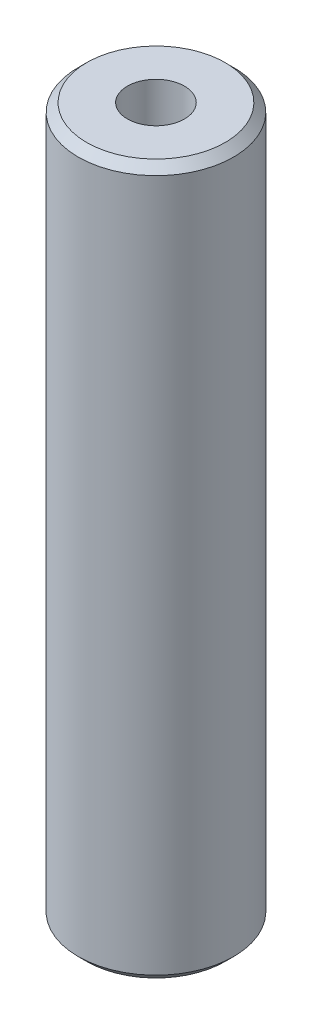
ISO-10303-21;
HEADER;
FILE_DESCRIPTION(('STEP AP214'),'2;1');
FILE_NAME('part.step','',(''),(''),'','','');
FILE_SCHEMA(('AUTOMOTIVE_DESIGN { 1 0 10303 214 1 1 1 1 }'));
ENDSEC;
DATA;
#1=APPLICATION_CONTEXT('core data for automotive mechanical design processes');
#2=APPLICATION_PROTOCOL_DEFINITION('international standard','automotive_design',2000,#1);
#3=PRODUCT_CONTEXT('',#1,'mechanical');
#4=PRODUCT('Part','Part','',(#3));
#5=PRODUCT_RELATED_PRODUCT_CATEGORY('part','',(#4));
#6=PRODUCT_DEFINITION_FORMATION('','',#4);
#7=PRODUCT_DEFINITION_CONTEXT('part definition',#1,'design');
#8=PRODUCT_DEFINITION('design','',#6,#7);
#9=PRODUCT_DEFINITION_SHAPE('','',#8);
#10=(LENGTH_UNIT() NAMED_UNIT(*) SI_UNIT(.MILLI.,.METRE.));
#11=(NAMED_UNIT(*) PLANE_ANGLE_UNIT() SI_UNIT($,.RADIAN.));
#12=(NAMED_UNIT(*) SI_UNIT($,.STERADIAN.) SOLID_ANGLE_UNIT());
#13=UNCERTAINTY_MEASURE_WITH_UNIT(LENGTH_MEASURE(1.E-05),#10,'distance_accuracy_value','');
#14=(GEOMETRIC_REPRESENTATION_CONTEXT(3) GLOBAL_UNCERTAINTY_ASSIGNED_CONTEXT((#13)) GLOBAL_UNIT_ASSIGNED_CONTEXT((#10,
#11,#12)) REPRESENTATION_CONTEXT('',''));
#15=CARTESIAN_POINT('',(0.,0.,0.));
#16=DIRECTION('',(0.,0.,1.));
#17=DIRECTION('',(1.,0.,0.));
#18=AXIS2_PLACEMENT_3D('',#15,#16,#17);
#19=CARTESIAN_POINT('',(0.,479.358730515074,0.));
#20=DIRECTION('',(0.,-1.,0.));
#21=DIRECTION('',(0.,0.,-1.));
#22=AXIS2_PLACEMENT_3D('',#19,#20,#21);
#23=CYLINDRICAL_SURFACE('',#22,52.5);
#24=CARTESIAN_POINT('',(0.,473.66451276738,0.));
#25=DIRECTION('',(0.,1.,0.));
#26=DIRECTION('',(0.,0.,1.));
#27=AXIS2_PLACEMENT_3D('',#24,#25,#26);
#28=CIRCLE('',#27,52.5);
#29=CARTESIAN_POINT('',(0.,473.66451276738,52.5));
#30=VERTEX_POINT('',#29);
#31=EDGE_CURVE('E50',#30,#30,#28,.F.);
#32=ORIENTED_EDGE('',*,*,#31,.T.);
#33=EDGE_LOOP('',(#32));
#34=FACE_BOUND('',#33,.T.);
#35=CARTESIAN_POINT('',(0.,5.69421774769352,0.));
#36=DIRECTION('',(0.,1.,0.));
#37=DIRECTION('',(0.,0.,1.));
#38=AXIS2_PLACEMENT_3D('',#35,#36,#37);
#39=CIRCLE('',#38,52.5);
#40=CARTESIAN_POINT('',(0.,5.69421774769352,52.5));
#41=VERTEX_POINT('',#40);
#42=EDGE_CURVE('E51',#41,#41,#39,.T.);
#43=ORIENTED_EDGE('',*,*,#42,.T.);
#44=EDGE_LOOP('',(#43));
#45=FACE_BOUND('',#44,.T.);
#46=ADVANCED_FACE('F39',(#34,#45),#23,.T.);
#47=CARTESIAN_POINT('',(0.,479.358730515074,0.));
#48=DIRECTION('',(0.,1.,0.));
#49=DIRECTION('',(0.,0.,1.));
#50=AXIS2_PLACEMENT_3D('',#47,#48,#49);
#51=PLANE('',#50);
#52=CARTESIAN_POINT('',(0.,479.358730515074,0.));
#53=DIRECTION('',(0.,1.,0.));
#54=DIRECTION('',(0.,0.,1.));
#55=AXIS2_PLACEMENT_3D('',#52,#53,#54);
#56=CIRCLE('',#55,46.8057822523066);
#57=CARTESIAN_POINT('',(0.,479.358730515074,46.8057822523066));
#58=VERTEX_POINT('',#57);
#59=EDGE_CURVE('E54',#58,#58,#56,.T.);
#60=ORIENTED_EDGE('',*,*,#59,.T.);
#61=EDGE_LOOP('',(#60));
#62=FACE_BOUND('',#61,.T.);
#63=CARTESIAN_POINT('',(0.,479.358730515074,0.));
#64=DIRECTION('',(0.,1.,0.));
#65=DIRECTION('',(0.,0.,1.));
#66=AXIS2_PLACEMENT_3D('',#63,#64,#65);
#67=CIRCLE('',#66,19.2745714888214);
#68=CARTESIAN_POINT('',(0.,479.358730515074,19.2745714888214));
#69=VERTEX_POINT('',#68);
#70=EDGE_CURVE('E58',#69,#69,#67,.T.);
#71=ORIENTED_EDGE('',*,*,#70,.F.);
#72=EDGE_LOOP('',(#71));
#73=FACE_BOUND('',#72,.T.);
#74=ADVANCED_FACE('F69',(#62,#73),#51,.T.);
#75=CARTESIAN_POINT('',(0.,0.,0.));
#76=DIRECTION('',(0.,1.,0.));
#77=DIRECTION('',(0.,0.,1.));
#78=AXIS2_PLACEMENT_3D('',#75,#76,#77);
#79=PLANE('',#78);
#80=CARTESIAN_POINT('',(0.,0.,0.));
#81=DIRECTION('',(0.,1.,0.));
#82=DIRECTION('',(0.,0.,1.));
#83=AXIS2_PLACEMENT_3D('',#80,#81,#82);
#84=CIRCLE('',#83,46.8057822523065);
#85=CARTESIAN_POINT('',(0.,0.,46.8057822523065));
#86=VERTEX_POINT('',#85);
#87=EDGE_CURVE('E10',#86,#86,#84,.F.);
#88=ORIENTED_EDGE('',*,*,#87,.T.);
#89=EDGE_LOOP('',(#88));
#90=FACE_BOUND('',#89,.T.);
#91=CARTESIAN_POINT('',(0.,0.,0.));
#92=DIRECTION('',(0.,1.,0.));
#93=DIRECTION('',(0.,0.,1.));
#94=AXIS2_PLACEMENT_3D('',#91,#92,#93);
#95=CIRCLE('',#94,19.2745714888214);
#96=CARTESIAN_POINT('',(0.,0.,19.2745714888214));
#97=VERTEX_POINT('',#96);
#98=EDGE_CURVE('E63',#97,#97,#95,.T.);
#99=ORIENTED_EDGE('',*,*,#98,.T.);
#100=EDGE_LOOP('',(#99));
#101=FACE_BOUND('',#100,.T.);
#102=ADVANCED_FACE('F75',(#90,#101),#79,.F.);
#103=CARTESIAN_POINT('',(0.,479.358730515074,0.));
#104=DIRECTION('',(0.,-1.,0.));
#105=DIRECTION('',(0.,0.,-1.));
#106=AXIS2_PLACEMENT_3D('',#103,#104,#105);
#107=CYLINDRICAL_SURFACE('',#106,19.2745714888214);
#108=ORIENTED_EDGE('',*,*,#70,.T.);
#109=EDGE_LOOP('',(#108));
#110=FACE_BOUND('',#109,.T.);
#111=ORIENTED_EDGE('',*,*,#98,.F.);
#112=EDGE_LOOP('',(#111));
#113=FACE_BOUND('',#112,.T.);
#114=ADVANCED_FACE('F70',(#110,#113),#107,.F.);
#115=CARTESIAN_POINT('',(0.,479.358730515074,0.));
#116=DIRECTION('',(0.,-1.,0.));
#117=DIRECTION('',(0.,0.,-1.));
#118=AXIS2_PLACEMENT_3D('',#115,#116,#117);
#119=CONICAL_SURFACE('',#118,46.8057822523066,0.785398163397444);
#120=ORIENTED_EDGE('',*,*,#31,.F.);
#121=EDGE_LOOP('',(#120));
#122=FACE_BOUND('',#121,.T.);
#123=ORIENTED_EDGE('',*,*,#59,.F.);
#124=EDGE_LOOP('',(#123));
#125=FACE_BOUND('',#124,.T.);
#126=ADVANCED_FACE('F81',(#122,#125),#119,.T.);
#127=CARTESIAN_POINT('',(0.,5.69421774769352,0.));
#128=DIRECTION('',(0.,1.,0.));
#129=DIRECTION('',(0.,0.,1.));
#130=AXIS2_PLACEMENT_3D('',#127,#128,#129);
#131=CONICAL_SURFACE('',#130,52.5,0.785398163397449);
#132=ORIENTED_EDGE('',*,*,#87,.F.);
#133=EDGE_LOOP('',(#132));
#134=FACE_BOUND('',#133,.T.);
#135=ORIENTED_EDGE('',*,*,#42,.F.);
#136=EDGE_LOOP('',(#135));
#137=FACE_BOUND('',#136,.T.);
#138=ADVANCED_FACE('F45',(#134,#137),#131,.T.);
#139=CLOSED_SHELL('',(#46,#74,#102,#114,#126,#138));
#140=MANIFOLD_SOLID_BREP('B2',#139);
#141=ADVANCED_BREP_SHAPE_REPRESENTATION('',(#18,#140),#14);
#142=SHAPE_DEFINITION_REPRESENTATION(#9,#141);
ENDSEC;
END-ISO-10303-21;
